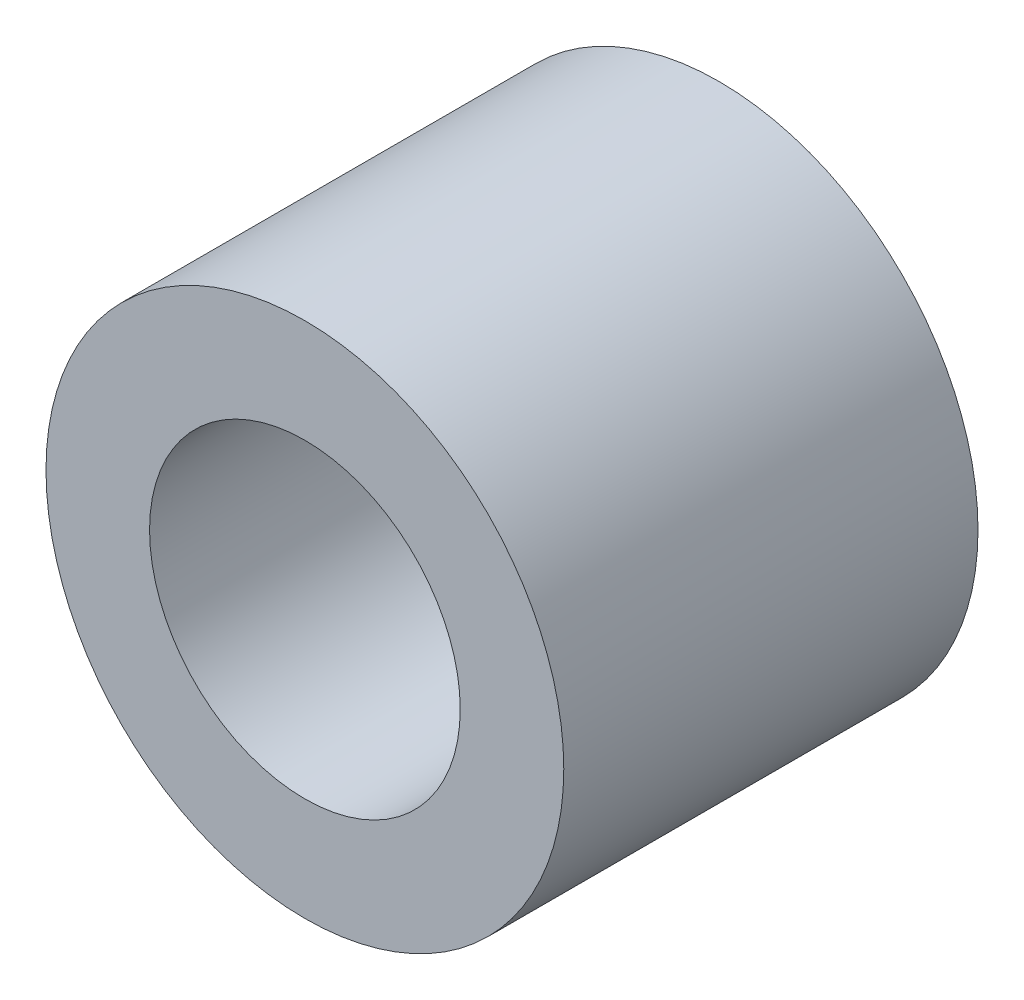
ISO-10303-21;
HEADER;
FILE_DESCRIPTION(('STEP AP214'),'2;1');
FILE_NAME('part.step','',(''),(''),'','','');
FILE_SCHEMA(('AUTOMOTIVE_DESIGN { 1 0 10303 214 1 1 1 1 }'));
ENDSEC;
DATA;
#1=APPLICATION_CONTEXT('core data for automotive mechanical design processes');
#2=APPLICATION_PROTOCOL_DEFINITION('international standard','automotive_design',2000,#1);
#3=PRODUCT_CONTEXT('',#1,'mechanical');
#4=PRODUCT('Part','Part','',(#3));
#5=PRODUCT_RELATED_PRODUCT_CATEGORY('part','',(#4));
#6=PRODUCT_DEFINITION_FORMATION('','',#4);
#7=PRODUCT_DEFINITION_CONTEXT('part definition',#1,'design');
#8=PRODUCT_DEFINITION('design','',#6,#7);
#9=PRODUCT_DEFINITION_SHAPE('','',#8);
#10=(LENGTH_UNIT() NAMED_UNIT(*) SI_UNIT(.MILLI.,.METRE.));
#11=(NAMED_UNIT(*) PLANE_ANGLE_UNIT() SI_UNIT($,.RADIAN.));
#12=(NAMED_UNIT(*) SI_UNIT($,.STERADIAN.) SOLID_ANGLE_UNIT());
#13=UNCERTAINTY_MEASURE_WITH_UNIT(LENGTH_MEASURE(1.E-05),#10,'distance_accuracy_value','');
#14=(GEOMETRIC_REPRESENTATION_CONTEXT(3) GLOBAL_UNCERTAINTY_ASSIGNED_CONTEXT((#13)) GLOBAL_UNIT_ASSIGNED_CONTEXT((#10,
#11,#12)) REPRESENTATION_CONTEXT('',''));
#15=CARTESIAN_POINT('',(0.,0.,0.));
#16=DIRECTION('',(0.,0.,1.));
#17=DIRECTION('',(1.,0.,0.));
#18=AXIS2_PLACEMENT_3D('',#15,#16,#17);
#19=CARTESIAN_POINT('',(0.,0.,4.));
#20=DIRECTION('',(0.,0.,1.));
#21=DIRECTION('',(1.,0.,0.));
#22=AXIS2_PLACEMENT_3D('',#19,#20,#21);
#23=PLANE('',#22);
#24=CARTESIAN_POINT('',(0.,0.,4.));
#25=DIRECTION('',(0.,0.,1.));
#26=DIRECTION('',(1.,0.,0.));
#27=AXIS2_PLACEMENT_3D('',#24,#25,#26);
#28=CIRCLE('',#27,2.5);
#29=CARTESIAN_POINT('',(2.5,0.,4.));
#30=VERTEX_POINT('',#29);
#31=EDGE_CURVE('E10',#30,#30,#28,.T.);
#32=ORIENTED_EDGE('',*,*,#31,.T.);
#33=EDGE_LOOP('',(#32));
#34=FACE_BOUND('',#33,.T.);
#35=CARTESIAN_POINT('',(0.,0.,4.));
#36=DIRECTION('',(0.,0.,1.));
#37=DIRECTION('',(1.,0.,0.));
#38=AXIS2_PLACEMENT_3D('',#35,#36,#37);
#39=CIRCLE('',#38,1.5);
#40=CARTESIAN_POINT('',(1.5,0.,4.));
#41=VERTEX_POINT('',#40);
#42=EDGE_CURVE('E50',#41,#41,#39,.T.);
#43=ORIENTED_EDGE('',*,*,#42,.F.);
#44=EDGE_LOOP('',(#43));
#45=FACE_BOUND('',#44,.T.);
#46=ADVANCED_FACE('F37',(#34,#45),#23,.T.);
#47=CARTESIAN_POINT('',(0.,0.,0.));
#48=DIRECTION('',(0.,0.,1.));
#49=DIRECTION('',(1.,0.,0.));
#50=AXIS2_PLACEMENT_3D('',#47,#48,#49);
#51=PLANE('',#50);
#52=CARTESIAN_POINT('',(0.,0.,0.));
#53=DIRECTION('',(0.,0.,1.));
#54=DIRECTION('',(1.,0.,0.));
#55=AXIS2_PLACEMENT_3D('',#52,#53,#54);
#56=CIRCLE('',#55,2.5);
#57=CARTESIAN_POINT('',(2.5,0.,0.));
#58=VERTEX_POINT('',#57);
#59=EDGE_CURVE('E41',#58,#58,#56,.T.);
#60=ORIENTED_EDGE('',*,*,#59,.F.);
#61=EDGE_LOOP('',(#60));
#62=FACE_BOUND('',#61,.T.);
#63=CARTESIAN_POINT('',(0.,0.,0.));
#64=DIRECTION('',(0.,0.,1.));
#65=DIRECTION('',(1.,0.,0.));
#66=AXIS2_PLACEMENT_3D('',#63,#64,#65);
#67=CIRCLE('',#66,1.5);
#68=CARTESIAN_POINT('',(1.5,0.,0.));
#69=VERTEX_POINT('',#68);
#70=EDGE_CURVE('E52',#69,#69,#67,.T.);
#71=ORIENTED_EDGE('',*,*,#70,.T.);
#72=EDGE_LOOP('',(#71));
#73=FACE_BOUND('',#72,.T.);
#74=ADVANCED_FACE('F64',(#62,#73),#51,.F.);
#75=CARTESIAN_POINT('',(0.,0.,4.));
#76=DIRECTION('',(0.,0.,-1.));
#77=DIRECTION('',(-1.,0.,0.));
#78=AXIS2_PLACEMENT_3D('',#75,#76,#77);
#79=CYLINDRICAL_SURFACE('',#78,2.5);
#80=ORIENTED_EDGE('',*,*,#31,.F.);
#81=EDGE_LOOP('',(#80));
#82=FACE_BOUND('',#81,.T.);
#83=ORIENTED_EDGE('',*,*,#59,.T.);
#84=EDGE_LOOP('',(#83));
#85=FACE_BOUND('',#84,.T.);
#86=ADVANCED_FACE('F39',(#82,#85),#79,.T.);
#87=CARTESIAN_POINT('',(0.,0.,4.));
#88=DIRECTION('',(0.,0.,-1.));
#89=DIRECTION('',(-1.,0.,0.));
#90=AXIS2_PLACEMENT_3D('',#87,#88,#89);
#91=CYLINDRICAL_SURFACE('',#90,1.5);
#92=ORIENTED_EDGE('',*,*,#42,.T.);
#93=EDGE_LOOP('',(#92));
#94=FACE_BOUND('',#93,.T.);
#95=ORIENTED_EDGE('',*,*,#70,.F.);
#96=EDGE_LOOP('',(#95));
#97=FACE_BOUND('',#96,.T.);
#98=ADVANCED_FACE('F60',(#94,#97),#91,.F.);
#99=CLOSED_SHELL('',(#46,#74,#86,#98));
#100=MANIFOLD_SOLID_BREP('B2',#99);
#101=ADVANCED_BREP_SHAPE_REPRESENTATION('',(#18,#100),#14);
#102=SHAPE_DEFINITION_REPRESENTATION(#9,#101);
ENDSEC;
END-ISO-10303-21;
